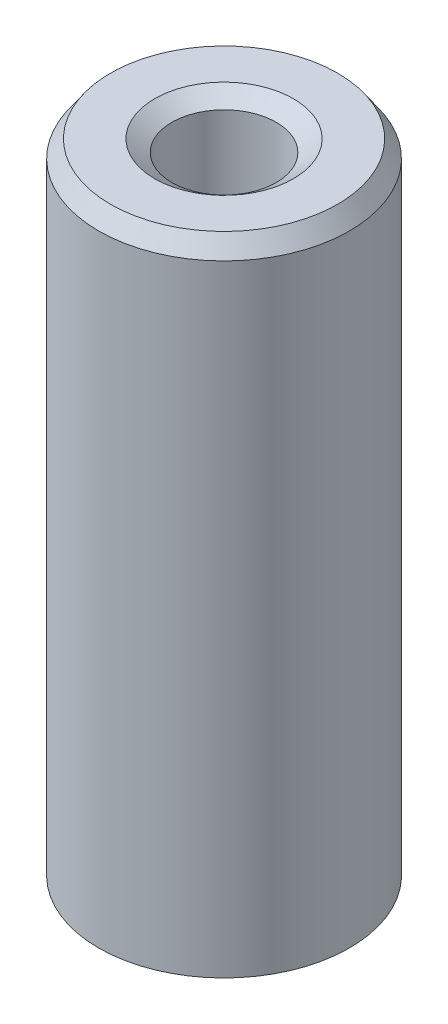
ISO-10303-21;
HEADER;
FILE_DESCRIPTION(('STEP AP214'),'2;1');
FILE_NAME('part.step','',(''),(''),'','','');
FILE_SCHEMA(('AUTOMOTIVE_DESIGN { 1 0 10303 214 1 1 1 1 }'));
ENDSEC;
DATA;
#1=APPLICATION_CONTEXT('core data for automotive mechanical design processes');
#2=APPLICATION_PROTOCOL_DEFINITION('international standard','automotive_design',2000,#1);
#3=PRODUCT_CONTEXT('',#1,'mechanical');
#4=PRODUCT('Part','Part','',(#3));
#5=PRODUCT_RELATED_PRODUCT_CATEGORY('part','',(#4));
#6=PRODUCT_DEFINITION_FORMATION('','',#4);
#7=PRODUCT_DEFINITION_CONTEXT('part definition',#1,'design');
#8=PRODUCT_DEFINITION('design','',#6,#7);
#9=PRODUCT_DEFINITION_SHAPE('','',#8);
#10=(LENGTH_UNIT() NAMED_UNIT(*) SI_UNIT(.MILLI.,.METRE.));
#11=(NAMED_UNIT(*) PLANE_ANGLE_UNIT() SI_UNIT($,.RADIAN.));
#12=(NAMED_UNIT(*) SI_UNIT($,.STERADIAN.) SOLID_ANGLE_UNIT());
#13=UNCERTAINTY_MEASURE_WITH_UNIT(LENGTH_MEASURE(1.E-05),#10,'distance_accuracy_value','');
#14=(GEOMETRIC_REPRESENTATION_CONTEXT(3) GLOBAL_UNCERTAINTY_ASSIGNED_CONTEXT((#13)) GLOBAL_UNIT_ASSIGNED_CONTEXT((#10,
#11,#12)) REPRESENTATION_CONTEXT('',''));
#15=CARTESIAN_POINT('',(0.,0.,0.));
#16=DIRECTION('',(0.,0.,1.));
#17=DIRECTION('',(1.,0.,0.));
#18=AXIS2_PLACEMENT_3D('',#15,#16,#17);
#19=CARTESIAN_POINT('',(0.,38.8571988485883,0.));
#20=DIRECTION('',(0.,-1.,0.));
#21=DIRECTION('',(0.,0.,-1.));
#22=AXIS2_PLACEMENT_3D('',#19,#20,#21);
#23=CYLINDRICAL_SURFACE('',#22,7.5);
#24=CARTESIAN_POINT('',(0.,0.70964227915786,0.));
#25=DIRECTION('',(0.,1.,0.));
#26=DIRECTION('',(0.,0.,1.));
#27=AXIS2_PLACEMENT_3D('',#24,#25,#26);
#28=CIRCLE('',#27,7.5);
#29=CARTESIAN_POINT('',(0.,0.70964227915786,7.5));
#30=VERTEX_POINT('',#29);
#31=EDGE_CURVE('E10',#30,#30,#28,.T.);
#32=ORIENTED_EDGE('',*,*,#31,.T.);
#33=EDGE_LOOP('',(#32));
#34=FACE_BOUND('',#33,.T.);
#35=CARTESIAN_POINT('',(0.,37.8315805358291,0.));
#36=DIRECTION('',(0.,1.,0.));
#37=DIRECTION('',(0.,0.,1.));
#38=AXIS2_PLACEMENT_3D('',#35,#36,#37);
#39=CIRCLE('',#38,7.5);
#40=CARTESIAN_POINT('',(0.,37.8315805358291,7.5));
#41=VERTEX_POINT('',#40);
#42=EDGE_CURVE('E50',#41,#41,#39,.F.);
#43=ORIENTED_EDGE('',*,*,#42,.T.);
#44=EDGE_LOOP('',(#43));
#45=FACE_BOUND('',#44,.T.);
#46=ADVANCED_FACE('F39',(#34,#45),#23,.T.);
#47=CARTESIAN_POINT('',(0.,38.8571988485883,0.));
#48=DIRECTION('',(0.,1.,0.));
#49=DIRECTION('',(0.,0.,1.));
#50=AXIS2_PLACEMENT_3D('',#47,#48,#49);
#51=PLANE('',#50);
#52=CARTESIAN_POINT('',(0.,38.8571988485883,0.));
#53=DIRECTION('',(0.,1.,0.));
#54=DIRECTION('',(0.,0.,1.));
#55=AXIS2_PLACEMENT_3D('',#52,#53,#54);
#56=CIRCLE('',#55,4.14741054353968);
#57=CARTESIAN_POINT('',(0.,38.8571988485883,4.14741054353967));
#58=VERTEX_POINT('',#57);
#59=EDGE_CURVE('E58',#58,#58,#56,.F.);
#60=ORIENTED_EDGE('',*,*,#59,.T.);
#61=EDGE_LOOP('',(#60));
#62=FACE_BOUND('',#61,.T.);
#63=CARTESIAN_POINT('',(0.,38.8571988485883,0.));
#64=DIRECTION('',(0.,1.,0.));
#65=DIRECTION('',(0.,0.,1.));
#66=AXIS2_PLACEMENT_3D('',#63,#64,#65);
#67=CIRCLE('',#66,6.79035772084214);
#68=CARTESIAN_POINT('',(0.,38.8571988485883,6.79035772084214));
#69=VERTEX_POINT('',#68);
#70=EDGE_CURVE('E61',#69,#69,#67,.T.);
#71=ORIENTED_EDGE('',*,*,#70,.T.);
#72=EDGE_LOOP('',(#71));
#73=FACE_BOUND('',#72,.T.);
#74=ADVANCED_FACE('F88',(#62,#73),#51,.T.);
#75=CARTESIAN_POINT('',(0.,0.,0.));
#76=DIRECTION('',(0.,1.,0.));
#77=DIRECTION('',(0.,0.,1.));
#78=AXIS2_PLACEMENT_3D('',#75,#76,#77);
#79=PLANE('',#78);
#80=CARTESIAN_POINT('',(0.,0.,0.));
#81=DIRECTION('',(0.,1.,0.));
#82=DIRECTION('',(0.,0.,1.));
#83=AXIS2_PLACEMENT_3D('',#80,#81,#82);
#84=CIRCLE('',#83,3.83143450993832);
#85=CARTESIAN_POINT('',(0.,0.,3.83143450993832));
#86=VERTEX_POINT('',#85);
#87=EDGE_CURVE('E51',#86,#86,#84,.T.);
#88=ORIENTED_EDGE('',*,*,#87,.T.);
#89=EDGE_LOOP('',(#88));
#90=FACE_BOUND('',#89,.T.);
#91=CARTESIAN_POINT('',(0.,0.,0.));
#92=DIRECTION('',(0.,1.,0.));
#93=DIRECTION('',(0.,0.,1.));
#94=AXIS2_PLACEMENT_3D('',#91,#92,#93);
#95=CIRCLE('',#94,6.47438168724078);
#96=CARTESIAN_POINT('',(0.,0.,6.47438168724078));
#97=VERTEX_POINT('',#96);
#98=EDGE_CURVE('E54',#97,#97,#95,.F.);
#99=ORIENTED_EDGE('',*,*,#98,.T.);
#100=EDGE_LOOP('',(#99));
#101=FACE_BOUND('',#100,.T.);
#102=ADVANCED_FACE('F83',(#90,#101),#79,.F.);
#103=CARTESIAN_POINT('',(0.,38.8571988485883,0.));
#104=DIRECTION('',(0.,-1.,0.));
#105=DIRECTION('',(0.,0.,-1.));
#106=AXIS2_PLACEMENT_3D('',#103,#104,#105);
#107=CYLINDRICAL_SURFACE('',#106,3.12179223078046);
#108=CARTESIAN_POINT('',(0.,38.1475565694304,0.));
#109=DIRECTION('',(0.,1.,0.));
#110=DIRECTION('',(0.,0.,1.));
#111=AXIS2_PLACEMENT_3D('',#108,#109,#110);
#112=CIRCLE('',#111,3.12179223078046);
#113=CARTESIAN_POINT('',(0.,38.1475565694304,3.12179223078045));
#114=VERTEX_POINT('',#113);
#115=EDGE_CURVE('E67',#114,#114,#112,.T.);
#116=ORIENTED_EDGE('',*,*,#115,.T.);
#117=EDGE_LOOP('',(#116));
#118=FACE_BOUND('',#117,.T.);
#119=CARTESIAN_POINT('',(0.,1.02561831275921,0.));
#120=DIRECTION('',(0.,1.,0.));
#121=DIRECTION('',(0.,0.,1.));
#122=AXIS2_PLACEMENT_3D('',#119,#120,#121);
#123=CIRCLE('',#122,3.12179223078046);
#124=CARTESIAN_POINT('',(0.,1.02561831275921,3.12179223078046));
#125=VERTEX_POINT('',#124);
#126=EDGE_CURVE('E69',#125,#125,#123,.F.);
#127=ORIENTED_EDGE('',*,*,#126,.T.);
#128=EDGE_LOOP('',(#127));
#129=FACE_BOUND('',#128,.T.);
#130=ADVANCED_FACE('F71',(#118,#129),#107,.F.);
#131=CARTESIAN_POINT('',(0.,38.1475565694304,0.));
#132=DIRECTION('',(0.,1.,0.));
#133=DIRECTION('',(0.,0.,1.));
#134=AXIS2_PLACEMENT_3D('',#131,#132,#133);
#135=CONICAL_SURFACE('',#134,3.12179223078046,0.965516127370391);
#136=CARTESIAN_POINT('',(0.,38.8571988485883,4.14741054353967));
#137=CARTESIAN_POINT('',(0.,38.8498067415137,4.13672701944843));
#138=CARTESIAN_POINT('',(0.,38.8424146344392,4.12604349535719));
#139=CARTESIAN_POINT('',(0.,38.82763042029,4.1046764471747));
#140=CARTESIAN_POINT('',(0.,38.8202383132155,4.09399292308346));
#141=CARTESIAN_POINT('',(0.,38.8054540990664,4.07262587490098));
#142=CARTESIAN_POINT('',(0.,38.7980619919918,4.06194235080974));
#143=CARTESIAN_POINT('',(0.,38.7832777778427,4.04057530262725));
#144=CARTESIAN_POINT('',(0.,38.7758856707681,4.02989177853601));
#145=CARTESIAN_POINT('',(0.,38.761101456619,4.00852473035353));
#146=CARTESIAN_POINT('',(0.,38.7537093495444,3.99784120626229));
#147=CARTESIAN_POINT('',(0.,38.7389251353953,3.9764741580798));
#148=CARTESIAN_POINT('',(0.,38.7315330283207,3.96579063398856));
#149=CARTESIAN_POINT('',(0.,38.7167488141716,3.94442358580608));
#150=CARTESIAN_POINT('',(0.,38.7093567070971,3.93374006171483));
#151=CARTESIAN_POINT('',(0.,38.6945724929479,3.91237301353235));
#152=CARTESIAN_POINT('',(0.,38.6871803858734,3.90168948944111));
#153=CARTESIAN_POINT('',(0.,38.6723961717243,3.88032244125862));
#154=CARTESIAN_POINT('',(0.,38.6650040646497,3.86963891716738));
#155=CARTESIAN_POINT('',(0.,38.6502198505006,3.8482718689849));
#156=CARTESIAN_POINT('',(0.,38.642827743426,3.83758834489366));
#157=CARTESIAN_POINT('',(0.,38.6280435292769,3.81622129671117));
#158=CARTESIAN_POINT('',(0.,38.6206514222023,3.80553777261993));
#159=CARTESIAN_POINT('',(0.,38.6058672080532,3.78417072443745));
#160=CARTESIAN_POINT('',(0.,38.5984751009786,3.77348720034621));
#161=CARTESIAN_POINT('',(0.,38.5836908868295,3.75212015216372));
#162=CARTESIAN_POINT('',(0.,38.576298779755,3.74143662807248));
#163=CARTESIAN_POINT('',(0.,38.5615145656058,3.72006957989));
#164=CARTESIAN_POINT('',(0.,38.5541224585313,3.70938605579875));
#165=CARTESIAN_POINT('',(0.,38.5393382443822,3.68801900761627));
#166=CARTESIAN_POINT('',(0.,38.5319461373076,3.67733548352503));
#167=CARTESIAN_POINT('',(0.,38.5171619231585,3.65596843534255));
#168=CARTESIAN_POINT('',(0.,38.5097698160839,3.6452849112513));
#169=CARTESIAN_POINT('',(0.,38.4949856019348,3.62391786306882));
#170=CARTESIAN_POINT('',(0.,38.4875934948602,3.61323433897758));
#171=CARTESIAN_POINT('',(0.,38.4728092807111,3.59186729079509));
#172=CARTESIAN_POINT('',(0.,38.4654171736365,3.58118376670385));
#173=CARTESIAN_POINT('',(0.,38.4506329594874,3.55981671852137));
#174=CARTESIAN_POINT('',(0.,38.4432408524129,3.54913319443013));
#175=CARTESIAN_POINT('',(0.,38.4284566382637,3.52776614624764));
#176=CARTESIAN_POINT('',(0.,38.4210645311892,3.5170826221564));
#177=CARTESIAN_POINT('',(0.,38.4062803170401,3.49571557397392));
#178=CARTESIAN_POINT('',(0.,38.3988882099655,3.48503204988267));
#179=CARTESIAN_POINT('',(0.,38.3841039958164,3.46366500170019));
#180=CARTESIAN_POINT('',(0.,38.3767118887418,3.45298147760895));
#181=CARTESIAN_POINT('',(0.,38.3619276745927,3.43161442942647));
#182=CARTESIAN_POINT('',(0.,38.3545355675181,3.42093090533522));
#183=CARTESIAN_POINT('',(0.,38.339751353369,3.39956385715274));
#184=CARTESIAN_POINT('',(0.,38.3323592462944,3.3888803330615));
#185=CARTESIAN_POINT('',(0.,38.3175750321453,3.36751328487901));
#186=CARTESIAN_POINT('',(0.,38.3101829250708,3.35682976078777));
#187=CARTESIAN_POINT('',(0.,38.2953987109216,3.33546271260529));
#188=CARTESIAN_POINT('',(0.,38.2880066038471,3.32477918851405));
#189=CARTESIAN_POINT('',(0.,38.273222389698,3.30341214033156));
#190=CARTESIAN_POINT('',(0.,38.2658302826234,3.29272861624032));
#191=CARTESIAN_POINT('',(0.,38.2510460684743,3.27136156805784));
#192=CARTESIAN_POINT('',(0.,38.2436539613997,3.2606780439666));
#193=CARTESIAN_POINT('',(0.,38.2288697472506,3.23931099578411));
#194=CARTESIAN_POINT('',(0.,38.221477640176,3.22862747169287));
#195=CARTESIAN_POINT('',(0.,38.2066934260269,3.20726042351039));
#196=CARTESIAN_POINT('',(0.,38.1993013189524,3.19657689941914));
#197=CARTESIAN_POINT('',(0.,38.1845171048032,3.17520985123666));
#198=CARTESIAN_POINT('',(0.,38.1771249977287,3.16452632714542));
#199=CARTESIAN_POINT('',(0.,38.1623407835795,3.14315927896294));
#200=CARTESIAN_POINT('',(0.,38.154948676505,3.13247575487169));
#201=CARTESIAN_POINT('',(0.,38.1475565694304,3.12179223078045));
#202=B_SPLINE_CURVE_WITH_KNOTS('',3,(#136,#137,#138,#139,#140,#141,#142,#143,#144,#145,#146,
#147,#148,#149,#150,#151,#152,#153,#154,#155,#156,#157,#158,#159,#160,#161,#162,#163,#164,#165,
#166,#167,#168,#169,#170,#171,#172,#173,#174,#175,#176,#177,#178,#179,#180,#181,#182,#183,#184,
#185,#186,#187,#188,#189,#190,#191,#192,#193,#194,#195,#196,#197,#198,#199,#200,#201),
.UNSPECIFIED.,.F.,.F.,(4,2,2,2,2,2,2,2,2,2,2,2,2,2,2,2,2,2,2,2,2,2,2,2,2,2,2,2,2,2,2,2,4),(0.,
0.0389747149584108,0.0779494299168216,0.116924144875232,0.155898859833639,0.19487357479205,
0.233848289750462,0.272823004708868,0.311797719667279,0.35077243462569,0.389747149584098,
0.428721864542508,0.467696579500919,0.506671294459327,0.545646009417737,0.584620724376149,
0.623595439334555,0.662570154292967,0.701544869251377,0.740519584209789,0.779494299168195,
0.818469014126607,0.857443729085017,0.896418444043424,0.935393159001835,0.974367873960246,
1.01334258891865,1.05231730387706,1.09129201883548,1.13026673379388,1.16924144875229,
1.2082161637107,1.24719087866911),.UNSPECIFIED.);
#203=EDGE_CURVE('BSEAM77',#58,#114,#202,.T.);
#204=ORIENTED_EDGE('',*,*,#59,.F.);
#205=ORIENTED_EDGE('',*,*,#115,.F.);
#206=ORIENTED_EDGE('',*,*,#203,.T.);
#207=ORIENTED_EDGE('',*,*,#203,.F.);
#208=EDGE_LOOP('',(#204,#206,#205,#207));
#209=FACE_BOUND('',#208,.T.);
#210=ADVANCED_FACE('F77',(#209),#135,.F.);
#211=CARTESIAN_POINT('',(0.,0.,0.));
#212=DIRECTION('',(0.,-1.,0.));
#213=DIRECTION('',(0.,0.,-1.));
#214=AXIS2_PLACEMENT_3D('',#211,#212,#213);
#215=CONICAL_SURFACE('',#214,3.83143450993832,0.605280199424508);
#216=ORIENTED_EDGE('',*,*,#126,.F.);
#217=EDGE_LOOP('',(#216));
#218=FACE_BOUND('',#217,.T.);
#219=ORIENTED_EDGE('',*,*,#87,.F.);
#220=EDGE_LOOP('',(#219));
#221=FACE_BOUND('',#220,.T.);
#222=ADVANCED_FACE('F73',(#218,#221),#215,.F.);
#223=CARTESIAN_POINT('',(0.,0.70964227915786,0.));
#224=DIRECTION('',(0.,1.,0.));
#225=DIRECTION('',(0.,0.,1.));
#226=AXIS2_PLACEMENT_3D('',#223,#224,#225);
#227=CONICAL_SURFACE('',#226,7.5,0.965516127370391);
#228=CARTESIAN_POINT('',(0.,0.,6.47438168724078));
#229=CARTESIAN_POINT('',(0.,0.00739210707456096,6.48506521133202));
#230=CARTESIAN_POINT('',(0.,0.014784214149122,6.49574873542326));
#231=CARTESIAN_POINT('',(0.,0.029568428298244,6.51711578360575));
#232=CARTESIAN_POINT('',(0.,0.0369605353728051,6.52779930769699));
#233=CARTESIAN_POINT('',(0.,0.0517447495219272,6.54916635587947));
#234=CARTESIAN_POINT('',(0.,0.0591368565964883,6.55984987997071));
#235=CARTESIAN_POINT('',(0.,0.0739210707456104,6.5812169281532));
#236=CARTESIAN_POINT('',(0.,0.0813131778201713,6.59190045224444));
#237=CARTESIAN_POINT('',(0.,0.0960973919692933,6.61326750042692));
#238=CARTESIAN_POINT('',(0.,0.103489499043854,6.62395102451817));
#239=CARTESIAN_POINT('',(0.,0.118273713192977,6.64531807270065));
#240=CARTESIAN_POINT('',(0.,0.125665820267538,6.65600159679189));
#241=CARTESIAN_POINT('',(0.,0.14045003441666,6.67736864497437));
#242=CARTESIAN_POINT('',(0.,0.147842141491221,6.68805216906562));
#243=CARTESIAN_POINT('',(0.,0.162626355640343,6.7094192172481));
#244=CARTESIAN_POINT('',(0.,0.170018462714904,6.72010274133934));
#245=CARTESIAN_POINT('',(0.,0.184802676864026,6.74146978952183));
#246=CARTESIAN_POINT('',(0.,0.192194783938587,6.75215331361307));
#247=CARTESIAN_POINT('',(0.,0.206978998087709,6.77352036179555));
#248=CARTESIAN_POINT('',(0.,0.21437110516227,6.78420388588679));
#249=CARTESIAN_POINT('',(0.,0.229155319311392,6.80557093406928));
#250=CARTESIAN_POINT('',(0.,0.236547426385953,6.81625445816052));
#251=CARTESIAN_POINT('',(0.,0.251331640535075,6.837621506343));
#252=CARTESIAN_POINT('',(0.,0.258723747609636,6.84830503043425));
#253=CARTESIAN_POINT('',(0.,0.273507961758758,6.86967207861673));
#254=CARTESIAN_POINT('',(0.,0.280900068833319,6.88035560270797));
#255=CARTESIAN_POINT('',(0.,0.295684282982442,6.90172265089045));
#256=CARTESIAN_POINT('',(0.,0.303076390057003,6.9124061749817));
#257=CARTESIAN_POINT('',(0.,0.317860604206125,6.93377322316418));
#258=CARTESIAN_POINT('',(0.,0.325252711280686,6.94445674725542));
#259=CARTESIAN_POINT('',(0.,0.340036925429808,6.96582379543791));
#260=CARTESIAN_POINT('',(0.,0.347429032504369,6.97650731952915));
#261=CARTESIAN_POINT('',(0.,0.362213246653491,6.99787436771163));
#262=CARTESIAN_POINT('',(0.,0.369605353728052,7.00855789180287));
#263=CARTESIAN_POINT('',(0.,0.384389567877174,7.02992493998536));
#264=CARTESIAN_POINT('',(0.,0.391781674951735,7.0406084640766));
#265=CARTESIAN_POINT('',(0.,0.406565889100857,7.06197551225908));
#266=CARTESIAN_POINT('',(0.,0.413957996175418,7.07265903635032));
#267=CARTESIAN_POINT('',(0.,0.42874221032454,7.09402608453281));
#268=CARTESIAN_POINT('',(0.,0.436134317399101,7.10470960862405));
#269=CARTESIAN_POINT('',(0.,0.450918531548223,7.12607665680653));
#270=CARTESIAN_POINT('',(0.,0.458310638622784,7.13676018089778));
#271=CARTESIAN_POINT('',(0.,0.473094852771907,7.15812722908026));
#272=CARTESIAN_POINT('',(0.,0.480486959846468,7.1688107531715));
#273=CARTESIAN_POINT('',(0.,0.49527117399559,7.19017780135398));
#274=CARTESIAN_POINT('',(0.,0.502663281070151,7.20086132544523));
#275=CARTESIAN_POINT('',(0.,0.517447495219273,7.22222837362771));
#276=CARTESIAN_POINT('',(0.,0.524839602293834,7.23291189771895));
#277=CARTESIAN_POINT('',(0.,0.539623816442956,7.25427894590144));
#278=CARTESIAN_POINT('',(0.,0.547015923517517,7.26496246999268));
#279=CARTESIAN_POINT('',(0.,0.561800137666639,7.28632951817516));
#280=CARTESIAN_POINT('',(0.,0.5691922447412,7.2970130422664));
#281=CARTESIAN_POINT('',(0.,0.583976458890322,7.31838009044889));
#282=CARTESIAN_POINT('',(0.,0.591368565964883,7.32906361454013));
#283=CARTESIAN_POINT('',(0.,0.606152780114005,7.35043066272261));
#284=CARTESIAN_POINT('',(0.,0.613544887188566,7.36111418681386));
#285=CARTESIAN_POINT('',(0.,0.628329101337688,7.38248123499634));
#286=CARTESIAN_POINT('',(0.,0.635721208412249,7.39316475908758));
#287=CARTESIAN_POINT('',(0.,0.650505422561372,7.41453180727006));
#288=CARTESIAN_POINT('',(0.,0.657897529635933,7.42521533136131));
#289=CARTESIAN_POINT('',(0.,0.672681743785055,7.44658237954379));
#290=CARTESIAN_POINT('',(0.,0.680073850859616,7.45726590363503));
#291=CARTESIAN_POINT('',(0.,0.694858065008738,7.47863295181752));
#292=CARTESIAN_POINT('',(0.,0.702250172083299,7.48931647590876));
#293=CARTESIAN_POINT('',(0.,0.70964227915786,7.5));
#294=B_SPLINE_CURVE_WITH_KNOTS('',3,(#228,#229,#230,#231,#232,#233,#234,#235,#236,#237,#238,
#239,#240,#241,#242,#243,#244,#245,#246,#247,#248,#249,#250,#251,#252,#253,#254,#255,#256,#257,
#258,#259,#260,#261,#262,#263,#264,#265,#266,#267,#268,#269,#270,#271,#272,#273,#274,#275,#276,
#277,#278,#279,#280,#281,#282,#283,#284,#285,#286,#287,#288,#289,#290,#291,#292,#293),
.UNSPECIFIED.,.F.,.F.,(4,2,2,2,2,2,2,2,2,2,2,2,2,2,2,2,2,2,2,2,2,2,2,2,2,2,2,2,2,2,2,2,4),(0.,
0.0389747149584096,0.0779494299168191,0.116924144875229,0.155898859833639,0.194873574792049,
0.233848289750458,0.272823004708868,0.311797719667278,0.350772434625688,0.389747149584097,
0.428721864542507,0.467696579500917,0.506671294459327,0.545646009417736,0.584620724376146,
0.623595439334556,0.662570154292966,0.701544869251375,0.740519584209784,0.779494299168195,
0.818469014126604,0.857443729085014,0.896418444043424,0.935393159001834,0.974367873960243,
1.01334258891865,1.05231730387706,1.09129201883547,1.13026673379388,1.16924144875229,
1.2082161637107,1.24719087866911),.UNSPECIFIED.);
#295=EDGE_CURVE('BSEAM76',#97,#30,#294,.T.);
#296=ORIENTED_EDGE('',*,*,#98,.F.);
#297=ORIENTED_EDGE('',*,*,#31,.F.);
#298=ORIENTED_EDGE('',*,*,#295,.T.);
#299=ORIENTED_EDGE('',*,*,#295,.F.);
#300=EDGE_LOOP('',(#296,#298,#297,#299));
#301=FACE_BOUND('',#300,.T.);
#302=ADVANCED_FACE('F76',(#301),#227,.T.);
#303=CARTESIAN_POINT('',(0.,38.8571988485883,0.));
#304=DIRECTION('',(0.,-1.,0.));
#305=DIRECTION('',(0.,0.,-1.));
#306=AXIS2_PLACEMENT_3D('',#303,#304,#305);
#307=CONICAL_SURFACE('',#306,6.79035772084214,0.605280199424505);
#308=ORIENTED_EDGE('',*,*,#42,.F.);
#309=EDGE_LOOP('',(#308));
#310=FACE_BOUND('',#309,.T.);
#311=ORIENTED_EDGE('',*,*,#70,.F.);
#312=EDGE_LOOP('',(#311));
#313=FACE_BOUND('',#312,.T.);
#314=ADVANCED_FACE('F45',(#310,#313),#307,.T.);
#315=CLOSED_SHELL('',(#46,#74,#102,#130,#210,#222,#302,#314));
#316=MANIFOLD_SOLID_BREP('B2',#315);
#317=ADVANCED_BREP_SHAPE_REPRESENTATION('',(#18,#316),#14);
#318=SHAPE_DEFINITION_REPRESENTATION(#9,#317);
ENDSEC;
END-ISO-10303-21;
